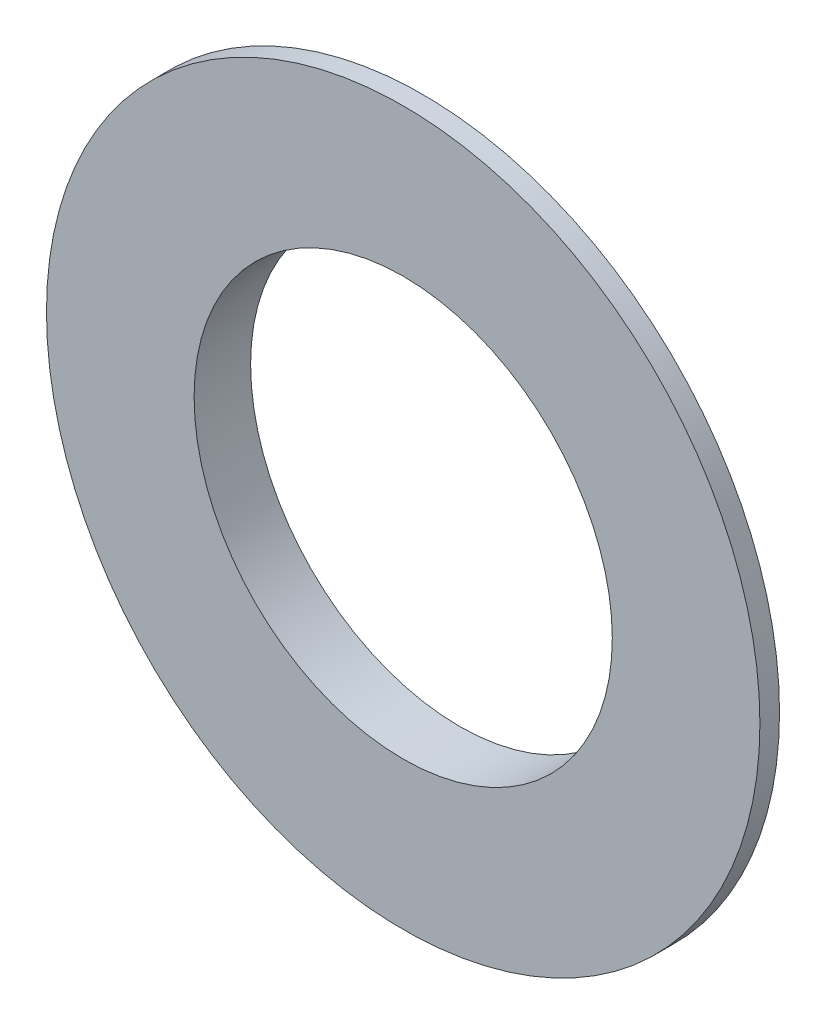
ISO-10303-21;
HEADER;
FILE_DESCRIPTION(('STEP AP214'),'2;1');
FILE_NAME('part.step','',(''),(''),'','','');
FILE_SCHEMA(('AUTOMOTIVE_DESIGN { 1 0 10303 214 1 1 1 1 }'));
ENDSEC;
DATA;
#1=APPLICATION_CONTEXT('core data for automotive mechanical design processes');
#2=APPLICATION_PROTOCOL_DEFINITION('international standard','automotive_design',2000,#1);
#3=PRODUCT_CONTEXT('',#1,'mechanical');
#4=PRODUCT('Part','Part','',(#3));
#5=PRODUCT_RELATED_PRODUCT_CATEGORY('part','',(#4));
#6=PRODUCT_DEFINITION_FORMATION('','',#4);
#7=PRODUCT_DEFINITION_CONTEXT('part definition',#1,'design');
#8=PRODUCT_DEFINITION('design','',#6,#7);
#9=PRODUCT_DEFINITION_SHAPE('','',#8);
#10=(LENGTH_UNIT() NAMED_UNIT(*) SI_UNIT(.MILLI.,.METRE.));
#11=(NAMED_UNIT(*) PLANE_ANGLE_UNIT() SI_UNIT($,.RADIAN.));
#12=(NAMED_UNIT(*) SI_UNIT($,.STERADIAN.) SOLID_ANGLE_UNIT());
#13=UNCERTAINTY_MEASURE_WITH_UNIT(LENGTH_MEASURE(1.E-05),#10,'distance_accuracy_value','');
#14=(GEOMETRIC_REPRESENTATION_CONTEXT(3) GLOBAL_UNCERTAINTY_ASSIGNED_CONTEXT((#13)) GLOBAL_UNIT_ASSIGNED_CONTEXT((#10,
#11,#12)) REPRESENTATION_CONTEXT('',''));
#15=CARTESIAN_POINT('',(0.,0.,0.));
#16=DIRECTION('',(0.,0.,1.));
#17=DIRECTION('',(1.,0.,0.));
#18=AXIS2_PLACEMENT_3D('',#15,#16,#17);
#19=CARTESIAN_POINT('',(-11.1,0.,0.));
#20=DIRECTION('',(0.,0.,-1.));
#21=DIRECTION('',(-1.,0.,0.));
#22=AXIS2_PLACEMENT_3D('',#19,#20,#21);
#23=PLANE('',#22);
#24=CARTESIAN_POINT('',(0.,0.,0.));
#25=DIRECTION('',(0.,0.,1.));
#26=DIRECTION('',(1.,0.,0.));
#27=AXIS2_PLACEMENT_3D('',#24,#25,#26);
#28=CIRCLE('',#27,11.1);
#29=CARTESIAN_POINT('',(11.1,0.,0.));
#30=VERTEX_POINT('',#29);
#31=EDGE_CURVE('E60',#30,#30,#28,.T.);
#32=ORIENTED_EDGE('',*,*,#31,.F.);
#33=EDGE_LOOP('',(#32));
#34=FACE_BOUND('',#33,.T.);
#35=CARTESIAN_POINT('',(0.,0.,0.));
#36=DIRECTION('',(0.,0.,1.));
#37=DIRECTION('',(1.,0.,0.));
#38=AXIS2_PLACEMENT_3D('',#35,#36,#37);
#39=CIRCLE('',#38,18.9367346938775);
#40=CARTESIAN_POINT('',(18.9367346938775,0.,0.));
#41=VERTEX_POINT('',#40);
#42=EDGE_CURVE('E10',#41,#41,#39,.T.);
#43=ORIENTED_EDGE('',*,*,#42,.T.);
#44=EDGE_LOOP('',(#43));
#45=FACE_BOUND('',#44,.T.);
#46=ADVANCED_FACE('F43',(#34,#45),#23,.F.);
#47=CARTESIAN_POINT('',(0.,0.,0.));
#48=DIRECTION('',(0.,0.,1.));
#49=DIRECTION('',(1.,0.,0.));
#50=AXIS2_PLACEMENT_3D('',#47,#48,#49);
#51=CYLINDRICAL_SURFACE('',#50,18.9367346938775);
#52=ORIENTED_EDGE('',*,*,#42,.F.);
#53=EDGE_LOOP('',(#52));
#54=FACE_BOUND('',#53,.T.);
#55=CARTESIAN_POINT('',(0.,0.,-1.0408163265306));
#56=DIRECTION('',(0.,0.,1.));
#57=DIRECTION('',(1.,0.,0.));
#58=AXIS2_PLACEMENT_3D('',#55,#56,#57);
#59=CIRCLE('',#58,18.9367346938775);
#60=CARTESIAN_POINT('',(18.9367346938775,0.,-1.0408163265306));
#61=VERTEX_POINT('',#60);
#62=EDGE_CURVE('E50',#61,#61,#59,.T.);
#63=ORIENTED_EDGE('',*,*,#62,.T.);
#64=EDGE_LOOP('',(#63));
#65=FACE_BOUND('',#64,.T.);
#66=ADVANCED_FACE('F70',(#54,#65),#51,.T.);
#67=CARTESIAN_POINT('',(0.,0.,-3.));
#68=DIRECTION('',(0.,0.,1.));
#69=DIRECTION('',(1.,0.,0.));
#70=AXIS2_PLACEMENT_3D('',#67,#68,#69);
#71=CONICAL_SURFACE('',#70,11.1,1.32581766366803);
#72=ORIENTED_EDGE('',*,*,#62,.F.);
#73=EDGE_LOOP('',(#72));
#74=FACE_BOUND('',#73,.T.);
#75=CARTESIAN_POINT('',(0.,0.,-3.));
#76=DIRECTION('',(0.,0.,1.));
#77=DIRECTION('',(1.,0.,0.));
#78=AXIS2_PLACEMENT_3D('',#75,#76,#77);
#79=CIRCLE('',#78,11.1);
#80=CARTESIAN_POINT('',(11.1,0.,-3.));
#81=VERTEX_POINT('',#80);
#82=EDGE_CURVE('E55',#81,#81,#79,.T.);
#83=ORIENTED_EDGE('',*,*,#82,.T.);
#84=EDGE_LOOP('',(#83));
#85=FACE_BOUND('',#84,.T.);
#86=ADVANCED_FACE('F74',(#74,#85),#71,.T.);
#87=CARTESIAN_POINT('',(0.,0.,0.));
#88=DIRECTION('',(0.,0.,1.));
#89=DIRECTION('',(1.,0.,0.));
#90=AXIS2_PLACEMENT_3D('',#87,#88,#89);
#91=CYLINDRICAL_SURFACE('',#90,11.1);
#92=ORIENTED_EDGE('',*,*,#82,.F.);
#93=EDGE_LOOP('',(#92));
#94=FACE_BOUND('',#93,.T.);
#95=ORIENTED_EDGE('',*,*,#31,.T.);
#96=EDGE_LOOP('',(#95));
#97=FACE_BOUND('',#96,.T.);
#98=ADVANCED_FACE('F67',(#94,#97),#91,.F.);
#99=CLOSED_SHELL('',(#46,#66,#86,#98));
#100=MANIFOLD_SOLID_BREP('B2',#99);
#101=ADVANCED_BREP_SHAPE_REPRESENTATION('',(#18,#100),#14);
#102=SHAPE_DEFINITION_REPRESENTATION(#9,#101);
ENDSEC;
END-ISO-10303-21;
